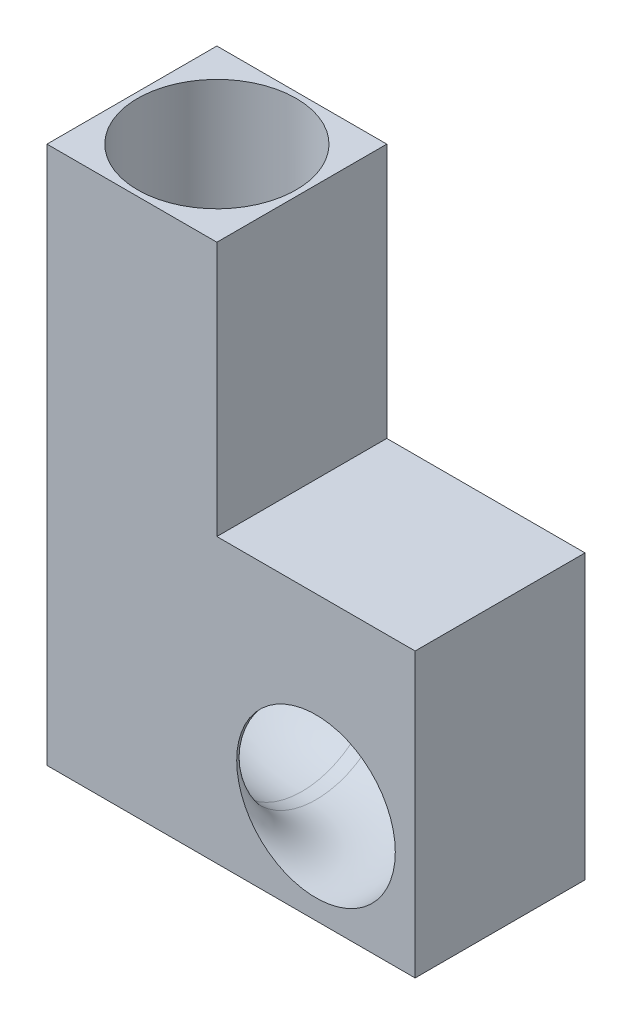
ISO-10303-21;
HEADER;
FILE_DESCRIPTION(('STEP AP214'),'2;1');
FILE_NAME('part.step','',(''),(''),'','','');
FILE_SCHEMA(('AUTOMOTIVE_DESIGN { 1 0 10303 214 1 1 1 1 }'));
ENDSEC;
DATA;
#1=APPLICATION_CONTEXT('core data for automotive mechanical design processes');
#2=APPLICATION_PROTOCOL_DEFINITION('international standard','automotive_design',2000,#1);
#3=PRODUCT_CONTEXT('',#1,'mechanical');
#4=PRODUCT('Part','Part','',(#3));
#5=PRODUCT_RELATED_PRODUCT_CATEGORY('part','',(#4));
#6=PRODUCT_DEFINITION_FORMATION('','',#4);
#7=PRODUCT_DEFINITION_CONTEXT('part definition',#1,'design');
#8=PRODUCT_DEFINITION('design','',#6,#7);
#9=PRODUCT_DEFINITION_SHAPE('','',#8);
#10=(LENGTH_UNIT() NAMED_UNIT(*) SI_UNIT(.MILLI.,.METRE.));
#11=(NAMED_UNIT(*) PLANE_ANGLE_UNIT() SI_UNIT($,.RADIAN.));
#12=(NAMED_UNIT(*) SI_UNIT($,.STERADIAN.) SOLID_ANGLE_UNIT());
#13=UNCERTAINTY_MEASURE_WITH_UNIT(LENGTH_MEASURE(1.E-05),#10,'distance_accuracy_value','');
#14=(GEOMETRIC_REPRESENTATION_CONTEXT(3) GLOBAL_UNCERTAINTY_ASSIGNED_CONTEXT((#13)) GLOBAL_UNIT_ASSIGNED_CONTEXT((#10,
#11,#12)) REPRESENTATION_CONTEXT('',''));
#15=CARTESIAN_POINT('',(0.,0.,0.));
#16=DIRECTION('',(0.,0.,1.));
#17=DIRECTION('',(1.,0.,0.));
#18=AXIS2_PLACEMENT_3D('',#15,#16,#17);
#19=CARTESIAN_POINT('',(0.,0.,76.2));
#20=DIRECTION('',(0.,0.,1.));
#21=DIRECTION('',(1.,0.,0.));
#22=AXIS2_PLACEMENT_3D('',#19,#20,#21);
#23=PLANE('',#22);
#24=DIRECTION('',(-1.,0.,0.));
#25=VECTOR('',#24,1.);
#26=CARTESIAN_POINT('',(76.2,241.3,76.2));
#27=LINE('',#26,#25);
#28=CARTESIAN_POINT('',(76.2,241.3,76.2));
#29=VERTEX_POINT('',#28);
#30=CARTESIAN_POINT('',(0.,241.3,76.2));
#31=VERTEX_POINT('',#30);
#32=EDGE_CURVE('E129',#29,#31,#27,.T.);
#33=ORIENTED_EDGE('',*,*,#32,.T.);
#34=DIRECTION('',(0.,-1.,0.));
#35=VECTOR('',#34,1.);
#36=CARTESIAN_POINT('',(0.,241.3,76.2));
#37=LINE('',#36,#35);
#38=CARTESIAN_POINT('',(0.,0.,76.2));
#39=VERTEX_POINT('',#38);
#40=EDGE_CURVE('E87',#31,#39,#37,.T.);
#41=ORIENTED_EDGE('',*,*,#40,.T.);
#42=DIRECTION('',(1.,0.,0.));
#43=VECTOR('',#42,1.);
#44=CARTESIAN_POINT('',(0.,0.,76.2));
#45=LINE('',#44,#43);
#46=CARTESIAN_POINT('',(165.1,0.,76.2));
#47=VERTEX_POINT('',#46);
#48=EDGE_CURVE('E100',#39,#47,#45,.T.);
#49=ORIENTED_EDGE('',*,*,#48,.T.);
#50=DIRECTION('',(0.,1.,0.));
#51=VECTOR('',#50,1.);
#52=CARTESIAN_POINT('',(165.1,0.,76.2));
#53=LINE('',#52,#51);
#54=CARTESIAN_POINT('',(165.1,127.,76.2));
#55=VERTEX_POINT('',#54);
#56=EDGE_CURVE('E94',#47,#55,#53,.T.);
#57=ORIENTED_EDGE('',*,*,#56,.T.);
#58=DIRECTION('',(-1.,0.,0.));
#59=VECTOR('',#58,1.);
#60=CARTESIAN_POINT('',(165.1,127.,76.2));
#61=LINE('',#60,#59);
#62=CARTESIAN_POINT('',(76.2,127.,76.2));
#63=VERTEX_POINT('',#62);
#64=EDGE_CURVE('E98',#55,#63,#61,.T.);
#65=ORIENTED_EDGE('',*,*,#64,.T.);
#66=DIRECTION('',(0.,1.,0.));
#67=VECTOR('',#66,1.);
#68=CARTESIAN_POINT('',(76.2,127.,76.2));
#69=LINE('',#68,#67);
#70=EDGE_CURVE('E50',#63,#29,#69,.T.);
#71=ORIENTED_EDGE('',*,*,#70,.T.);
#72=EDGE_LOOP('',(#33,#41,#49,#57,#65,#71));
#73=FACE_BOUND('',#72,.T.);
#74=CARTESIAN_POINT('',(120.65,44.45,76.2));
#75=DIRECTION('',(0.,0.,-1.));
#76=DIRECTION('',(-1.,0.,0.));
#77=AXIS2_PLACEMENT_3D('',#74,#75,#76);
#78=CIRCLE('',#77,35.56);
#79=CARTESIAN_POINT('',(156.21,44.45,76.2));
#80=VERTEX_POINT('',#79);
#81=EDGE_CURVE('E122',#80,#80,#78,.T.);
#82=ORIENTED_EDGE('',*,*,#81,.T.);
#83=EDGE_LOOP('',(#82));
#84=FACE_BOUND('',#83,.T.);
#85=ADVANCED_FACE('F33',(#73,#84),#23,.T.);
#86=CARTESIAN_POINT('',(76.2,241.3,76.2));
#87=DIRECTION('',(0.,-1.,0.));
#88=DIRECTION('',(0.,0.,-1.));
#89=AXIS2_PLACEMENT_3D('',#86,#87,#88);
#90=PLANE('',#89);
#91=CARTESIAN_POINT('',(38.1,241.3,38.1));
#92=DIRECTION('',(0.,1.,0.));
#93=DIRECTION('',(0.,0.,1.));
#94=AXIS2_PLACEMENT_3D('',#91,#92,#93);
#95=CIRCLE('',#94,35.56);
#96=CARTESIAN_POINT('',(38.1,241.3,73.66));
#97=VERTEX_POINT('',#96);
#98=EDGE_CURVE('E183',#97,#97,#95,.T.);
#99=ORIENTED_EDGE('',*,*,#98,.F.);
#100=EDGE_LOOP('',(#99));
#101=FACE_BOUND('',#100,.T.);
#102=DIRECTION('',(-1.,0.,0.));
#103=VECTOR('',#102,1.);
#104=CARTESIAN_POINT('',(76.2,241.3,0.));
#105=LINE('',#104,#103);
#106=CARTESIAN_POINT('',(76.2,241.3,0.));
#107=VERTEX_POINT('',#106);
#108=CARTESIAN_POINT('',(0.,241.3,0.));
#109=VERTEX_POINT('',#108);
#110=EDGE_CURVE('E118',#107,#109,#105,.T.);
#111=ORIENTED_EDGE('',*,*,#110,.T.);
#112=DIRECTION('',(0.,0.,-1.));
#113=VECTOR('',#112,1.);
#114=CARTESIAN_POINT('',(0.,241.3,76.2));
#115=LINE('',#114,#113);
#116=EDGE_CURVE('E11',#31,#109,#115,.T.);
#117=ORIENTED_EDGE('',*,*,#116,.F.);
#118=ORIENTED_EDGE('',*,*,#32,.F.);
#119=DIRECTION('',(0.,0.,-1.));
#120=VECTOR('',#119,1.);
#121=CARTESIAN_POINT('',(76.2,241.3,76.2));
#122=LINE('',#121,#120);
#123=EDGE_CURVE('E114',#29,#107,#122,.T.);
#124=ORIENTED_EDGE('',*,*,#123,.T.);
#125=EDGE_LOOP('',(#111,#117,#118,#124));
#126=FACE_BOUND('',#125,.T.);
#127=ADVANCED_FACE('F35',(#101,#126),#90,.F.);
#128=CARTESIAN_POINT('',(0.,241.3,76.2));
#129=DIRECTION('',(1.,0.,0.));
#130=DIRECTION('',(0.,1.,0.));
#131=AXIS2_PLACEMENT_3D('',#128,#129,#130);
#132=PLANE('',#131);
#133=DIRECTION('',(0.,-1.,0.));
#134=VECTOR('',#133,1.);
#135=CARTESIAN_POINT('',(0.,241.3,0.));
#136=LINE('',#135,#134);
#137=CARTESIAN_POINT('',(0.,0.,0.));
#138=VERTEX_POINT('',#137);
#139=EDGE_CURVE('E121',#109,#138,#136,.T.);
#140=ORIENTED_EDGE('',*,*,#139,.T.);
#141=DIRECTION('',(0.,0.,-1.));
#142=VECTOR('',#141,1.);
#143=CARTESIAN_POINT('',(0.,0.,76.2));
#144=LINE('',#143,#142);
#145=EDGE_CURVE('E42',#39,#138,#144,.T.);
#146=ORIENTED_EDGE('',*,*,#145,.F.);
#147=ORIENTED_EDGE('',*,*,#40,.F.);
#148=ORIENTED_EDGE('',*,*,#116,.T.);
#149=EDGE_LOOP('',(#140,#146,#147,#148));
#150=FACE_BOUND('',#149,.T.);
#151=ADVANCED_FACE('F158',(#150),#132,.F.);
#152=CARTESIAN_POINT('',(0.,0.,76.2));
#153=DIRECTION('',(0.,1.,0.));
#154=DIRECTION('',(0.,0.,1.));
#155=AXIS2_PLACEMENT_3D('',#152,#153,#154);
#156=PLANE('',#155);
#157=DIRECTION('',(1.,0.,0.));
#158=VECTOR('',#157,1.);
#159=CARTESIAN_POINT('',(0.,0.,0.));
#160=LINE('',#159,#158);
#161=CARTESIAN_POINT('',(165.1,0.,0.));
#162=VERTEX_POINT('',#161);
#163=EDGE_CURVE('E124',#138,#162,#160,.T.);
#164=ORIENTED_EDGE('',*,*,#163,.T.);
#165=DIRECTION('',(0.,0.,-1.));
#166=VECTOR('',#165,1.);
#167=CARTESIAN_POINT('',(165.1,0.,76.2));
#168=LINE('',#167,#166);
#169=EDGE_CURVE('E109',#47,#162,#168,.T.);
#170=ORIENTED_EDGE('',*,*,#169,.F.);
#171=ORIENTED_EDGE('',*,*,#48,.F.);
#172=ORIENTED_EDGE('',*,*,#145,.T.);
#173=EDGE_LOOP('',(#164,#170,#171,#172));
#174=FACE_BOUND('',#173,.T.);
#175=ADVANCED_FACE('F135',(#174),#156,.F.);
#176=CARTESIAN_POINT('',(165.1,0.,76.2));
#177=DIRECTION('',(-1.,0.,0.));
#178=DIRECTION('',(0.,0.,1.));
#179=AXIS2_PLACEMENT_3D('',#176,#177,#178);
#180=PLANE('',#179);
#181=DIRECTION('',(0.,1.,0.));
#182=VECTOR('',#181,1.);
#183=CARTESIAN_POINT('',(165.1,0.,0.));
#184=LINE('',#183,#182);
#185=CARTESIAN_POINT('',(165.1,127.,0.));
#186=VERTEX_POINT('',#185);
#187=EDGE_CURVE('E108',#162,#186,#184,.T.);
#188=ORIENTED_EDGE('',*,*,#187,.T.);
#189=DIRECTION('',(0.,0.,-1.));
#190=VECTOR('',#189,1.);
#191=CARTESIAN_POINT('',(165.1,127.,76.2));
#192=LINE('',#191,#190);
#193=EDGE_CURVE('E105',#55,#186,#192,.T.);
#194=ORIENTED_EDGE('',*,*,#193,.F.);
#195=ORIENTED_EDGE('',*,*,#56,.F.);
#196=ORIENTED_EDGE('',*,*,#169,.T.);
#197=EDGE_LOOP('',(#188,#194,#195,#196));
#198=FACE_BOUND('',#197,.T.);
#199=ADVANCED_FACE('F106',(#198),#180,.F.);
#200=CARTESIAN_POINT('',(165.1,127.,76.2));
#201=DIRECTION('',(0.,-1.,0.));
#202=DIRECTION('',(0.,0.,-1.));
#203=AXIS2_PLACEMENT_3D('',#200,#201,#202);
#204=PLANE('',#203);
#205=DIRECTION('',(-1.,0.,0.));
#206=VECTOR('',#205,1.);
#207=CARTESIAN_POINT('',(165.1,127.,0.));
#208=LINE('',#207,#206);
#209=CARTESIAN_POINT('',(76.2,127.,0.));
#210=VERTEX_POINT('',#209);
#211=EDGE_CURVE('E73',#186,#210,#208,.T.);
#212=ORIENTED_EDGE('',*,*,#211,.T.);
#213=DIRECTION('',(0.,0.,-1.));
#214=VECTOR('',#213,1.);
#215=CARTESIAN_POINT('',(76.2,127.,76.2));
#216=LINE('',#215,#214);
#217=EDGE_CURVE('E110',#63,#210,#216,.T.);
#218=ORIENTED_EDGE('',*,*,#217,.F.);
#219=ORIENTED_EDGE('',*,*,#64,.F.);
#220=ORIENTED_EDGE('',*,*,#193,.T.);
#221=EDGE_LOOP('',(#212,#218,#219,#220));
#222=FACE_BOUND('',#221,.T.);
#223=ADVANCED_FACE('F112',(#222),#204,.F.);
#224=CARTESIAN_POINT('',(76.2,127.,76.2));
#225=DIRECTION('',(-1.,0.,0.));
#226=DIRECTION('',(0.,0.,1.));
#227=AXIS2_PLACEMENT_3D('',#224,#225,#226);
#228=PLANE('',#227);
#229=DIRECTION('',(0.,1.,0.));
#230=VECTOR('',#229,1.);
#231=CARTESIAN_POINT('',(76.2,127.,0.));
#232=LINE('',#231,#230);
#233=EDGE_CURVE('E79',#210,#107,#232,.T.);
#234=ORIENTED_EDGE('',*,*,#233,.T.);
#235=ORIENTED_EDGE('',*,*,#123,.F.);
#236=ORIENTED_EDGE('',*,*,#70,.F.);
#237=ORIENTED_EDGE('',*,*,#217,.T.);
#238=EDGE_LOOP('',(#234,#235,#236,#237));
#239=FACE_BOUND('',#238,.T.);
#240=ADVANCED_FACE('F142',(#239),#228,.F.);
#241=CARTESIAN_POINT('',(0.,0.,0.));
#242=DIRECTION('',(0.,0.,1.));
#243=DIRECTION('',(1.,0.,0.));
#244=AXIS2_PLACEMENT_3D('',#241,#242,#243);
#245=PLANE('',#244);
#246=ORIENTED_EDGE('',*,*,#110,.F.);
#247=ORIENTED_EDGE('',*,*,#233,.F.);
#248=ORIENTED_EDGE('',*,*,#211,.F.);
#249=ORIENTED_EDGE('',*,*,#187,.F.);
#250=ORIENTED_EDGE('',*,*,#163,.F.);
#251=ORIENTED_EDGE('',*,*,#139,.F.);
#252=EDGE_LOOP('',(#246,#247,#248,#249,#250,#251));
#253=FACE_BOUND('',#252,.T.);
#254=ADVANCED_FACE('F138',(#253),#245,.F.);
#255=CARTESIAN_POINT('',(82.55,44.45,76.2));
#256=DIRECTION('',(0.,-1.,0.));
#257=DIRECTION('',(0.,0.,-1.));
#258=AXIS2_PLACEMENT_3D('',#255,#256,#257);
#259=TOROIDAL_SURFACE('',#258,38.1,35.56);
#260=CARTESIAN_POINT('',(82.55,44.45,38.1));
#261=DIRECTION('',(-1.,0.,0.));
#262=DIRECTION('',(0.,0.,1.));
#263=AXIS2_PLACEMENT_3D('',#260,#261,#262);
#264=CIRCLE('',#263,35.56);
#265=CARTESIAN_POINT('',(82.55,44.45,2.53999999999997));
#266=VERTEX_POINT('',#265);
#267=EDGE_CURVE('E190',#266,#266,#264,.T.);
#268=CARTESIAN_POINT('',(82.55,44.45,76.2));
#269=DIRECTION('',(0.,-1.,0.));
#270=DIRECTION('',(0.,0.,-1.));
#271=AXIS2_PLACEMENT_3D('',#268,#269,#270);
#272=CIRCLE('',#271,73.66);
#273=EDGE_CURVE('',#266,#80,#272,.T.);
#274=ORIENTED_EDGE('',*,*,#267,.T.);
#275=ORIENTED_EDGE('',*,*,#81,.F.);
#276=ORIENTED_EDGE('',*,*,#273,.T.);
#277=ORIENTED_EDGE('',*,*,#273,.F.);
#278=EDGE_LOOP('',(#274,#276,#275,#277));
#279=FACE_BOUND('',#278,.T.);
#280=ADVANCED_FACE('F149',(#279),#259,.F.);
#281=CARTESIAN_POINT('',(76.2,44.45,38.1));
#282=DIRECTION('',(1.,0.,0.));
#283=DIRECTION('',(0.,0.,-1.));
#284=AXIS2_PLACEMENT_3D('',#281,#282,#283);
#285=CYLINDRICAL_SURFACE('',#284,35.56);
#286=CARTESIAN_POINT('',(76.2,44.45,38.1));
#287=DIRECTION('',(-1.,0.,0.));
#288=DIRECTION('',(0.,0.,1.));
#289=AXIS2_PLACEMENT_3D('',#286,#287,#288);
#290=CIRCLE('',#289,35.56);
#291=CARTESIAN_POINT('',(76.2,8.89000000000001,38.1));
#292=VERTEX_POINT('',#291);
#293=EDGE_CURVE('E185',#292,#292,#290,.T.);
#294=ORIENTED_EDGE('',*,*,#293,.T.);
#295=EDGE_LOOP('',(#294));
#296=FACE_BOUND('',#295,.T.);
#297=ORIENTED_EDGE('',*,*,#267,.F.);
#298=EDGE_LOOP('',(#297));
#299=FACE_BOUND('',#298,.T.);
#300=ADVANCED_FACE('F163',(#296,#299),#285,.F.);
#301=CARTESIAN_POINT('',(76.2,82.55,38.1));
#302=DIRECTION('',(0.,0.,1.));
#303=DIRECTION('',(1.,0.,0.));
#304=AXIS2_PLACEMENT_3D('',#301,#302,#303);
#305=TOROIDAL_SURFACE('',#304,38.1,35.56);
#306=CARTESIAN_POINT('',(38.1,82.55,38.1));
#307=DIRECTION('',(0.,1.,0.));
#308=DIRECTION('',(0.,0.,1.));
#309=AXIS2_PLACEMENT_3D('',#306,#307,#308);
#310=CIRCLE('',#309,35.56);
#311=CARTESIAN_POINT('',(2.53999999999999,82.55,38.1));
#312=VERTEX_POINT('',#311);
#313=EDGE_CURVE('E180',#312,#312,#310,.T.);
#314=CARTESIAN_POINT('',(76.2,82.55,38.1));
#315=DIRECTION('',(0.,0.,1.));
#316=DIRECTION('',(1.,0.,0.));
#317=AXIS2_PLACEMENT_3D('',#314,#315,#316);
#318=CIRCLE('',#317,73.66);
#319=EDGE_CURVE('',#312,#292,#318,.T.);
#320=ORIENTED_EDGE('',*,*,#313,.T.);
#321=ORIENTED_EDGE('',*,*,#293,.F.);
#322=ORIENTED_EDGE('',*,*,#319,.T.);
#323=ORIENTED_EDGE('',*,*,#319,.F.);
#324=EDGE_LOOP('',(#320,#322,#321,#323));
#325=FACE_BOUND('',#324,.T.);
#326=ADVANCED_FACE('F167',(#325),#305,.F.);
#327=CARTESIAN_POINT('',(38.1,82.55,38.1));
#328=DIRECTION('',(0.,1.,0.));
#329=DIRECTION('',(0.,0.,1.));
#330=AXIS2_PLACEMENT_3D('',#327,#328,#329);
#331=CYLINDRICAL_SURFACE('',#330,35.56);
#332=ORIENTED_EDGE('',*,*,#313,.F.);
#333=EDGE_LOOP('',(#332));
#334=FACE_BOUND('',#333,.T.);
#335=ORIENTED_EDGE('',*,*,#98,.T.);
#336=EDGE_LOOP('',(#335));
#337=FACE_BOUND('',#336,.T.);
#338=ADVANCED_FACE('F171',(#334,#337),#331,.F.);
#339=CLOSED_SHELL('',(#85,#127,#151,#175,#199,#223,#240,#254,#280,#300,#326,#338));
#340=MANIFOLD_SOLID_BREP('B2',#339);
#341=ADVANCED_BREP_SHAPE_REPRESENTATION('',(#18,#340),#14);
#342=SHAPE_DEFINITION_REPRESENTATION(#9,#341);
ENDSEC;
END-ISO-10303-21;
